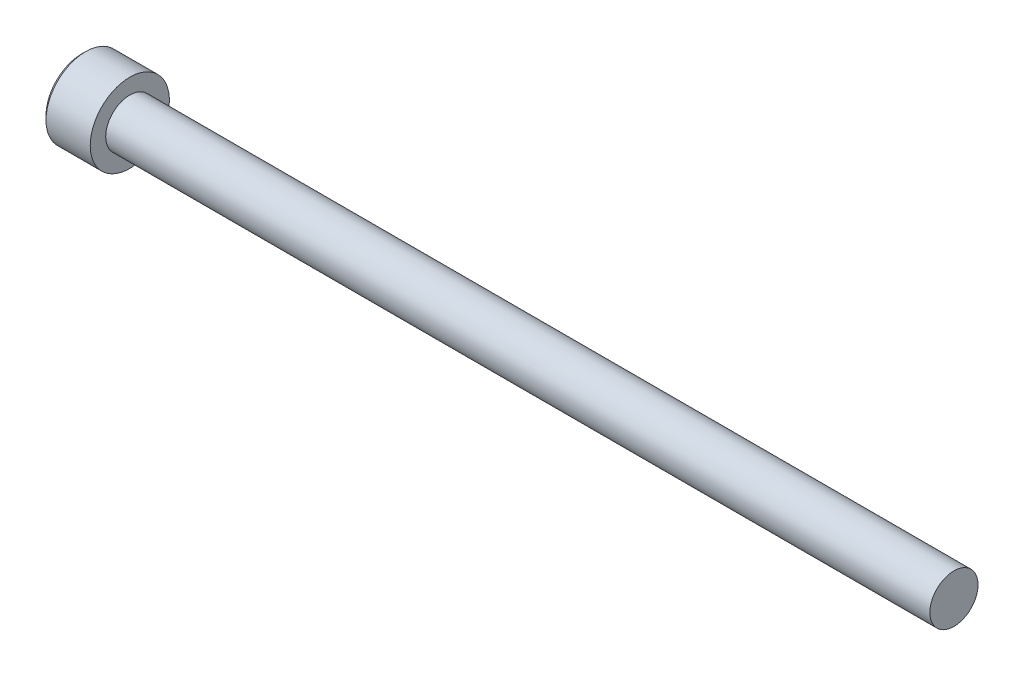
ISO-10303-21;
HEADER;
FILE_DESCRIPTION(('STEP AP214'),'2;1');
FILE_NAME('part.step','',(''),(''),'','','');
FILE_SCHEMA(('AUTOMOTIVE_DESIGN { 1 0 10303 214 1 1 1 1 }'));
ENDSEC;
DATA;
#1=APPLICATION_CONTEXT('core data for automotive mechanical design processes');
#2=APPLICATION_PROTOCOL_DEFINITION('international standard','automotive_design',2000,#1);
#3=PRODUCT_CONTEXT('',#1,'mechanical');
#4=PRODUCT('Part','Part','',(#3));
#5=PRODUCT_RELATED_PRODUCT_CATEGORY('part','',(#4));
#6=PRODUCT_DEFINITION_FORMATION('','',#4);
#7=PRODUCT_DEFINITION_CONTEXT('part definition',#1,'design');
#8=PRODUCT_DEFINITION('design','',#6,#7);
#9=PRODUCT_DEFINITION_SHAPE('','',#8);
#10=(LENGTH_UNIT() NAMED_UNIT(*) SI_UNIT(.MILLI.,.METRE.));
#11=(NAMED_UNIT(*) PLANE_ANGLE_UNIT() SI_UNIT($,.RADIAN.));
#12=(NAMED_UNIT(*) SI_UNIT($,.STERADIAN.) SOLID_ANGLE_UNIT());
#13=UNCERTAINTY_MEASURE_WITH_UNIT(LENGTH_MEASURE(1.E-05),#10,'distance_accuracy_value','');
#14=(GEOMETRIC_REPRESENTATION_CONTEXT(3) GLOBAL_UNCERTAINTY_ASSIGNED_CONTEXT((#13)) GLOBAL_UNIT_ASSIGNED_CONTEXT((#10,
#11,#12)) REPRESENTATION_CONTEXT('',''));
#15=CARTESIAN_POINT('',(0.,0.,0.));
#16=DIRECTION('',(0.,0.,1.));
#17=DIRECTION('',(1.,0.,0.));
#18=AXIS2_PLACEMENT_3D('',#15,#16,#17);
#19=CARTESIAN_POINT('',(-2.28600000000007,-1.14567944042317,1.984375));
#20=DIRECTION('',(0.,0.,1.));
#21=DIRECTION('',(1.,0.,0.));
#22=AXIS2_PLACEMENT_3D('',#19,#20,#21);
#23=PLANE('',#22);
#24=CARTESIAN_POINT('',(-4.82599999995852,1.14567944044653,1.98437499999554));
#25=CARTESIAN_POINT('',(-4.78691618362732,1.06743880343266,1.9843749999984));
#26=CARTESIAN_POINT('',(-4.75011447684892,0.987898318960917,1.98437499999957));
#27=CARTESIAN_POINT('',(-4.68265620500518,0.825677042028778,1.98437500000043));
#28=CARTESIAN_POINT('',(-4.65204056061138,0.742979382529199,1.98437500000012));
#29=CARTESIAN_POINT('',(-4.5991739228306,0.575193959555969,1.98437499999988));
#30=CARTESIAN_POINT('',(-4.57689462080725,0.490115359117279,1.98437499999997));
#31=CARTESIAN_POINT('',(-4.54259467221837,0.318093091130193,1.98437500000003));
#32=CARTESIAN_POINT('',(-4.5305423022885,0.231156054976726,1.984375));
#33=CARTESIAN_POINT('',(-4.52249110263747,0.119918521511051,1.984375));
#34=CARTESIAN_POINT('',(-4.52118947557477,0.0959468443046798,1.984375));
#35=CARTESIAN_POINT('',(-4.51945182629813,0.0479845644411998,1.984375));
#36=CARTESIAN_POINT('',(-4.51901533386223,0.0239939791589393,1.984375));
#37=CARTESIAN_POINT('',(-4.51901809008399,-0.0602201717457363,1.984375));
#38=CARTESIAN_POINT('',(-4.52177452299902,-0.120461721905447,1.984375));
#39=CARTESIAN_POINT('',(-4.5326365512493,-0.240474970989197,1.984375));
#40=CARTESIAN_POINT('',(-4.54074587749718,-0.300246312758427,1.984375));
#41=CARTESIAN_POINT('',(-4.57259622946939,-0.478763752804282,1.984375));
#42=CARTESIAN_POINT('',(-4.60385422611702,-0.596208828937734,1.984375));
#43=CARTESIAN_POINT('',(-4.66780003592237,-0.785921487441256,1.984375));
#44=CARTESIAN_POINT('',(-4.69623457768558,-0.859734609866899,1.984375));
#45=CARTESIAN_POINT('',(-4.75786140400812,-1.00456595519282,1.984375));
#46=CARTESIAN_POINT('',(-4.79100779300359,-1.07560356657101,1.984375));
#47=CARTESIAN_POINT('',(-4.82599999995643,-1.14567944044724,1.984375));
#48=B_SPLINE_CURVE_WITH_KNOTS('',3,(#24,#25,#26,#27,#28,#29,#30,#31,#32,#33,#34,#35,#36,#37,#38,
#39,#40,#41,#42,#43,#44,#45,#46,#47),.UNSPECIFIED.,.F.,.F.,(4,2,2,2,2,2,2,2,2,2,2,4),(0.,
0.262559005207405,0.526801735838036,0.790138824405318,1.05265603861765,1.12466619182083,
1.19663719499031,1.3772702672652,1.55802937209382,1.92104085090328,2.15819130092264,
2.39317265078575),.UNSPECIFIED.);
#49=CARTESIAN_POINT('',(-4.82599999996829,1.14567944041753,1.98437500003084));
#50=VERTEX_POINT('',#49);
#51=CARTESIAN_POINT('',(-4.8259999999622,-1.14567944043207,1.98437500001542));
#52=VERTEX_POINT('',#51);
#53=EDGE_CURVE('E20',#50,#52,#48,.T.);
#54=ORIENTED_EDGE('',*,*,#53,.F.);
#55=DIRECTION('',(1.,0.,0.));
#56=VECTOR('',#55,1.);
#57=CARTESIAN_POINT('',(-2.28600000000007,1.14567944042316,1.984375));
#58=LINE('',#57,#56);
#59=CARTESIAN_POINT('',(-2.28600000000007,1.14567944042316,1.984375));
#60=VERTEX_POINT('',#59);
#61=EDGE_CURVE('E68',#50,#60,#58,.T.);
#62=ORIENTED_EDGE('',*,*,#61,.T.);
#63=DIRECTION('',(0.,1.,0.));
#64=VECTOR('',#63,1.);
#65=CARTESIAN_POINT('',(-2.28600000000007,0.,1.984375));
#66=LINE('',#65,#64);
#67=CARTESIAN_POINT('',(-2.28600000000007,-1.14567944042317,1.984375));
#68=VERTEX_POINT('',#67);
#69=EDGE_CURVE('E74',#68,#60,#66,.T.);
#70=ORIENTED_EDGE('',*,*,#69,.F.);
#71=DIRECTION('',(1.,0.,0.));
#72=VECTOR('',#71,1.);
#73=CARTESIAN_POINT('',(-2.28600000000007,-1.14567944042317,1.984375));
#74=LINE('',#73,#72);
#75=EDGE_CURVE('E71',#68,#52,#74,.F.);
#76=ORIENTED_EDGE('',*,*,#75,.T.);
#77=EDGE_LOOP('',(#54,#62,#70,#76));
#78=FACE_BOUND('',#77,.T.);
#79=ADVANCED_FACE('F16',(#78),#23,.F.);
#80=CARTESIAN_POINT('',(-2.28600000000007,0.,0.));
#81=DIRECTION('',(-1.,0.,0.));
#82=DIRECTION('',(0.,0.,1.));
#83=AXIS2_PLACEMENT_3D('',#80,#81,#82);
#84=PLANE('',#83);
#85=DIRECTION('',(0.,0.5,0.866025403784439));
#86=VECTOR('',#85,1.);
#87=CARTESIAN_POINT('',(-2.28600000000007,2.29135888084633,0.));
#88=LINE('',#87,#86);
#89=CARTESIAN_POINT('',(-2.28600000000007,2.29135888084633,0.));
#90=VERTEX_POINT('',#89);
#91=CARTESIAN_POINT('',(-2.28600000000007,1.14567944042316,-1.984375));
#92=VERTEX_POINT('',#91);
#93=EDGE_CURVE('E82',#90,#92,#88,.F.);
#94=ORIENTED_EDGE('',*,*,#93,.T.);
#95=DIRECTION('',(0.,1.,0.));
#96=VECTOR('',#95,1.);
#97=CARTESIAN_POINT('',(-2.28600000000007,1.14567944042316,-1.984375));
#98=LINE('',#97,#96);
#99=CARTESIAN_POINT('',(-2.28600000000007,-1.14567944042316,-1.984375));
#100=VERTEX_POINT('',#99);
#101=EDGE_CURVE('E242',#92,#100,#98,.F.);
#102=ORIENTED_EDGE('',*,*,#101,.T.);
#103=DIRECTION('',(0.,0.5,-0.866025403784439));
#104=VECTOR('',#103,1.);
#105=CARTESIAN_POINT('',(-2.28600000000007,-1.14567944042316,-1.984375));
#106=LINE('',#105,#104);
#107=CARTESIAN_POINT('',(-2.28600000000007,-2.29135888084633,0.));
#108=VERTEX_POINT('',#107);
#109=EDGE_CURVE('E227',#100,#108,#106,.F.);
#110=ORIENTED_EDGE('',*,*,#109,.T.);
#111=DIRECTION('',(0.,-0.5,-0.866025403784439));
#112=VECTOR('',#111,1.);
#113=CARTESIAN_POINT('',(-2.28600000000007,-2.29135888084633,0.));
#114=LINE('',#113,#112);
#115=EDGE_CURVE('E224',#108,#68,#114,.F.);
#116=ORIENTED_EDGE('',*,*,#115,.T.);
#117=ORIENTED_EDGE('',*,*,#69,.T.);
#118=DIRECTION('',(0.,-0.5,0.866025403784439));
#119=VECTOR('',#118,1.);
#120=CARTESIAN_POINT('',(-2.28600000000007,1.14567944042316,1.984375));
#121=LINE('',#120,#119);
#122=EDGE_CURVE('E81',#60,#90,#121,.F.);
#123=ORIENTED_EDGE('',*,*,#122,.T.);
#124=EDGE_LOOP('',(#94,#102,#110,#116,#117,#123));
#125=FACE_BOUND('',#124,.T.);
#126=ADVANCED_FACE('F160',(#125),#84,.T.);
#127=CARTESIAN_POINT('',(-2.28600000000007,-1.14567944042316,-1.984375));
#128=DIRECTION('',(0.,-0.866025403784439,-0.5));
#129=DIRECTION('',(0.,0.5,-0.866025403784439));
#130=AXIS2_PLACEMENT_3D('',#127,#128,#129);
#131=PLANE('',#130);
#132=CARTESIAN_POINT('',(-4.82599999995871,-1.14567944040756,-1.98437500001887));
#133=CARTESIAN_POINT('',(-4.78666022792997,-1.18505700230148,-1.91617106214563));
#134=CARTESIAN_POINT('',(-4.74963132844072,-1.22509295783734,-1.8468267530301));
#135=CARTESIAN_POINT('',(-4.68183299424977,-1.30673037975396,-1.70542659047317));
#136=CARTESIAN_POINT('',(-4.65110127019237,-1.34833960561553,-1.63335729721673));
#137=CARTESIAN_POINT('',(-4.59845762010516,-1.432242568594,-1.48803310243203));
#138=CARTESIAN_POINT('',(-4.57641341195893,-1.47451494967301,-1.41481519064643));
#139=CARTESIAN_POINT('',(-4.54245011067441,-1.55999007976842,-1.26676792253773));
#140=CARTESIAN_POINT('',(-4.53050567471972,-1.6031902195197,-1.19194308559438));
#141=CARTESIAN_POINT('',(-4.51972842752365,-1.67764765054852,-1.06297903205139));
#142=CARTESIAN_POINT('',(-4.51813352794834,-1.70880881707173,-1.00900630841009));
#143=CARTESIAN_POINT('',(-4.52082392138599,-1.77108016542046,-0.901149169214274));
#144=CARTESIAN_POINT('',(-4.52511127545884,-1.80219032554946,-0.847264791239237));
#145=CARTESIAN_POINT('',(-4.53932219421538,-1.86411684097343,-0.740004920189235));
#146=CARTESIAN_POINT('',(-4.54925206045723,-1.8949328285454,-0.686630064029166));
#147=CARTESIAN_POINT('',(-4.5742029484467,-1.95603190279815,-0.580803363127978));
#148=CARTESIAN_POINT('',(-4.58922357974385,-1.98631503016081,-0.528351447923769));
#149=CARTESIAN_POINT('',(-4.63380478900425,-2.06386502548479,-0.394030915895904));
#150=CARTESIAN_POINT('',(-4.66672213384104,-2.11065153226583,-0.312994309042484));
#151=CARTESIAN_POINT('',(-4.72228952038986,-2.17944749410732,-0.193836207777459));
#152=CARTESIAN_POINT('',(-4.74181309375939,-2.20211890802843,-0.154568166986659));
#153=CARTESIAN_POINT('',(-4.78263970065987,-2.24704195201531,-0.0767591723707469));
#154=CARTESIAN_POINT('',(-4.80394164363173,-2.2692938292399,-0.0382177904539708));
#155=CARTESIAN_POINT('',(-4.82599999995675,-2.29135888085868,2.13931096265935E-11));
#156=B_SPLINE_CURVE_WITH_KNOTS('',3,(#132,#133,#134,#135,#136,#137,#138,#139,#140,#141,#142,
#143,#144,#145,#146,#147,#148,#149,#150,#151,#152,#153,#154,#155),.UNSPECIFIED.,.F.,.F.,(4,2,2,
2,2,2,2,2,2,2,2,4),(0.,0.264284909626495,0.530108996358094,0.791712695414128,1.05265800174404,
1.23942150116703,1.42625045663858,1.61328847394198,1.80031214908683,2.09727151182814,
2.24534838946042,2.39333511890876),.UNSPECIFIED.);
#157=CARTESIAN_POINT('',(-4.8259999999622,-1.14567944043207,-1.98437500001542));
#158=VERTEX_POINT('',#157);
#159=CARTESIAN_POINT('',(-4.82599999996846,-2.2913588808704,-2.00043543490866E-11));
#160=VERTEX_POINT('',#159);
#161=EDGE_CURVE('E162',#158,#160,#156,.T.);
#162=ORIENTED_EDGE('',*,*,#161,.T.);
#163=DIRECTION('',(1.,0.,0.));
#164=VECTOR('',#163,1.);
#165=CARTESIAN_POINT('',(-2.28600000000007,-2.29135888084633,0.));
#166=LINE('',#165,#164);
#167=EDGE_CURVE('E235',#160,#108,#166,.T.);
#168=ORIENTED_EDGE('',*,*,#167,.T.);
#169=ORIENTED_EDGE('',*,*,#109,.F.);
#170=DIRECTION('',(-1.,0.,0.));
#171=VECTOR('',#170,1.);
#172=CARTESIAN_POINT('',(-2.28600000000007,-1.14567944042316,-1.984375));
#173=LINE('',#172,#171);
#174=EDGE_CURVE('E245',#100,#158,#173,.T.);
#175=ORIENTED_EDGE('',*,*,#174,.T.);
#176=EDGE_LOOP('',(#162,#168,#169,#175));
#177=FACE_BOUND('',#176,.T.);
#178=ADVANCED_FACE('F156',(#177),#131,.F.);
#179=CARTESIAN_POINT('',(-2.28600000000007,-2.29135888084633,0.));
#180=DIRECTION('',(0.,-0.866025403784439,0.5));
#181=DIRECTION('',(0.,-0.5,-0.866025403784439));
#182=AXIS2_PLACEMENT_3D('',#179,#180,#181);
#183=PLANE('',#182);
#184=CARTESIAN_POINT('',(-4.8259999999587,-2.29135888085486,-2.29477011545215E-11));
#185=CARTESIAN_POINT('',(-4.78666022792997,-2.25198131896546,0.0682039378529047));
#186=CARTESIAN_POINT('',(-4.74963132844072,-2.21194536343147,0.137548246969502));
#187=CARTESIAN_POINT('',(-4.68183299424977,-2.13030794151622,0.278948409527228));
#188=CARTESIAN_POINT('',(-4.65110127019237,-2.08869871565414,0.351017702783377));
#189=CARTESIAN_POINT('',(-4.59845762010516,-2.00479575267531,0.496341897567867));
#190=CARTESIAN_POINT('',(-4.57641341195893,-1.96252337159644,0.569559809353539));
#191=CARTESIAN_POINT('',(-4.5424501106744,-1.87704824150112,0.717607077462299));
#192=CARTESIAN_POINT('',(-4.53050567471972,-1.8338481017498,0.792431914405622));
#193=CARTESIAN_POINT('',(-4.51972842752365,-1.75939067072096,0.921395967948603));
#194=CARTESIAN_POINT('',(-4.51813352794834,-1.72822950419776,0.975368691589913));
#195=CARTESIAN_POINT('',(-4.52082392138599,-1.66595815584903,1.08322583078573));
#196=CARTESIAN_POINT('',(-4.52511127545884,-1.63484799572003,1.13711020876076));
#197=CARTESIAN_POINT('',(-4.53932219421538,-1.57292148029607,1.24437007981077));
#198=CARTESIAN_POINT('',(-4.54925206045723,-1.54210549272409,1.29774493597084));
#199=CARTESIAN_POINT('',(-4.5742029484467,-1.48100641847134,1.40357163687202));
#200=CARTESIAN_POINT('',(-4.58922357974385,-1.45072329110868,1.45602355207623));
#201=CARTESIAN_POINT('',(-4.63380478900421,-1.37317329578476,1.59034408410398));
#202=CARTESIAN_POINT('',(-4.66672213384095,-1.32638678900379,1.6713806909573));
#203=CARTESIAN_POINT('',(-4.72228952038968,-1.25759082716239,1.79053879222216));
#204=CARTESIAN_POINT('',(-4.74181309375917,-1.23491941324131,1.82980683301291));
#205=CARTESIAN_POINT('',(-4.78263970065959,-1.18999636925449,1.90761582762873));
#206=CARTESIAN_POINT('',(-4.8039416436314,-1.16774449202993,1.94615720954545));
#207=CARTESIAN_POINT('',(-4.82599999995639,-1.14567944041117,1.98437500002077));
#208=B_SPLINE_CURVE_WITH_KNOTS('',3,(#184,#185,#186,#187,#188,#189,#190,#191,#192,#193,#194,
#195,#196,#197,#198,#199,#200,#201,#202,#203,#204,#205,#206,#207),.UNSPECIFIED.,.F.,.F.,(4,2,2,
2,2,2,2,2,2,2,2,4),(0.,0.264284909626493,0.530108996358089,0.791712695414125,1.05265800174404,
1.23942150116703,1.42625045663858,1.61328847394198,1.80031214908683,2.09727151182773,
2.24534838945981,2.39333511890795),.UNSPECIFIED.);
#209=EDGE_CURVE('E91',#160,#52,#208,.T.);
#210=ORIENTED_EDGE('',*,*,#209,.T.);
#211=ORIENTED_EDGE('',*,*,#75,.F.);
#212=ORIENTED_EDGE('',*,*,#115,.F.);
#213=ORIENTED_EDGE('',*,*,#167,.F.);
#214=EDGE_LOOP('',(#210,#211,#212,#213));
#215=FACE_BOUND('',#214,.T.);
#216=ADVANCED_FACE('F151',(#215),#183,.F.);
#217=CARTESIAN_POINT('',(-2.28600000000007,1.14567944042316,1.984375));
#218=DIRECTION('',(0.,0.866025403784439,0.5));
#219=DIRECTION('',(0.,-0.5,0.866025403784439));
#220=AXIS2_PLACEMENT_3D('',#217,#218,#219);
#221=PLANE('',#220);
#222=CARTESIAN_POINT('',(-4.82599999995852,1.14567944040762,1.98437500001801));
#223=CARTESIAN_POINT('',(-4.78666022792973,1.1850570023017,1.91617106214498));
#224=CARTESIAN_POINT('',(-4.74963132844047,1.22509295783761,1.84682675302957));
#225=CARTESIAN_POINT('',(-4.68183299424957,1.30673037975422,1.70542659047278));
#226=CARTESIAN_POINT('',(-4.65110127019222,1.34833960561574,1.63335729721638));
#227=CARTESIAN_POINT('',(-4.59845762010509,1.43224256859413,1.48803310243178));
#228=CARTESIAN_POINT('',(-4.57641341195888,1.47451494967311,1.41481519064625));
#229=CARTESIAN_POINT('',(-4.54245011067439,1.55999007976846,1.26676792253767));
#230=CARTESIAN_POINT('',(-4.53050567471972,1.6031902195197,1.19194308559439));
#231=CARTESIAN_POINT('',(-4.51972842752365,1.67764765054848,1.06297903205146));
#232=CARTESIAN_POINT('',(-4.51813352794835,1.70880881707169,1.00900630841016));
#233=CARTESIAN_POINT('',(-4.52082392138598,1.77108016542041,0.901149169214364));
#234=CARTESIAN_POINT('',(-4.52511127545883,1.80219032554941,0.847264791239333));
#235=CARTESIAN_POINT('',(-4.53932219421536,1.86411684097336,0.740004920189342));
#236=CARTESIAN_POINT('',(-4.54925206045721,1.89493282854533,0.686630064029278));
#237=CARTESIAN_POINT('',(-4.57420294844667,1.95603190279808,0.5808033631281));
#238=CARTESIAN_POINT('',(-4.58922357974382,1.98631503016074,0.528351447923897));
#239=CARTESIAN_POINT('',(-4.6338047890042,2.06386502548473,0.394030915896012));
#240=CARTESIAN_POINT('',(-4.666722133841,2.11065153226578,0.312994309042568));
#241=CARTESIAN_POINT('',(-4.72228952038984,2.17944749410729,0.19383620777751));
#242=CARTESIAN_POINT('',(-4.74181309375937,2.20211890802841,0.1545681669867));
#243=CARTESIAN_POINT('',(-4.78263970065986,2.24704195201529,0.0767591723707674));
#244=CARTESIAN_POINT('',(-4.80394164363172,2.26929382923989,0.0382177904539813));
#245=CARTESIAN_POINT('',(-4.82599999995675,2.29135888085868,-2.1392886942985E-11));
#246=B_SPLINE_CURVE_WITH_KNOTS('',3,(#222,#223,#224,#225,#226,#227,#228,#229,#230,#231,#232,
#233,#234,#235,#236,#237,#238,#239,#240,#241,#242,#243,#244,#245),.UNSPECIFIED.,.F.,.F.,(4,2,2,
2,2,2,2,2,2,2,2,4),(0.,0.26428490962629,0.530108996357672,0.791712695413487,1.05265800174319,
1.23942150116616,1.42625045663768,1.61328847394106,1.80031214908589,2.09727151182728,
2.2453483894596,2.39333511890798),.UNSPECIFIED.);
#247=CARTESIAN_POINT('',(-4.82599999996846,2.29135888087039,2.00042061038936E-11));
#248=VERTEX_POINT('',#247);
#249=EDGE_CURVE('E79',#50,#248,#246,.T.);
#250=ORIENTED_EDGE('',*,*,#249,.T.);
#251=DIRECTION('',(1.,0.,0.));
#252=VECTOR('',#251,1.);
#253=CARTESIAN_POINT('',(-2.28600000000007,2.29135888084633,0.));
#254=LINE('',#253,#252);
#255=EDGE_CURVE('E246',#248,#90,#254,.T.);
#256=ORIENTED_EDGE('',*,*,#255,.T.);
#257=ORIENTED_EDGE('',*,*,#122,.F.);
#258=ORIENTED_EDGE('',*,*,#61,.F.);
#259=EDGE_LOOP('',(#250,#256,#257,#258));
#260=FACE_BOUND('',#259,.T.);
#261=ADVANCED_FACE('F76',(#260),#221,.F.);
#262=CARTESIAN_POINT('',(-2.28600000000007,2.29135888084633,0.));
#263=DIRECTION('',(0.,0.866025403784439,-0.5));
#264=DIRECTION('',(0.,0.5,0.866025403784439));
#265=AXIS2_PLACEMENT_3D('',#262,#263,#264);
#266=PLANE('',#265);
#267=CARTESIAN_POINT('',(-4.82599999995871,2.29135888085486,2.29489280696874E-11));
#268=CARTESIAN_POINT('',(-4.78666022792997,2.25198131896547,-0.0682039378529039));
#269=CARTESIAN_POINT('',(-4.74963132844072,2.21194536343147,-0.137548246969502));
#270=CARTESIAN_POINT('',(-4.68183299424977,2.13030794151622,-0.278948409527229));
#271=CARTESIAN_POINT('',(-4.65110127019237,2.08869871565414,-0.351017702783379));
#272=CARTESIAN_POINT('',(-4.59845762010516,2.00479575267531,-0.496341897567869));
#273=CARTESIAN_POINT('',(-4.57641341195893,1.96252337159644,-0.569559809353541));
#274=CARTESIAN_POINT('',(-4.5424501106744,1.87704824150112,-0.7176070774623));
#275=CARTESIAN_POINT('',(-4.53050567471972,1.8338481017498,-0.792431914405622));
#276=CARTESIAN_POINT('',(-4.51972842752365,1.75939067072096,-0.921395967948603));
#277=CARTESIAN_POINT('',(-4.51813352794834,1.72822950419776,-0.975368691589912));
#278=CARTESIAN_POINT('',(-4.52082392138599,1.66595815584903,-1.08322583078573));
#279=CARTESIAN_POINT('',(-4.52511127545884,1.63484799572003,-1.13711020876076));
#280=CARTESIAN_POINT('',(-4.53932219421538,1.57292148029607,-1.24437007981077));
#281=CARTESIAN_POINT('',(-4.54925206045723,1.54210549272409,-1.29774493597083));
#282=CARTESIAN_POINT('',(-4.5742029484467,1.48100641847134,-1.40357163687202));
#283=CARTESIAN_POINT('',(-4.58922357974385,1.45072329110868,-1.45602355207623));
#284=CARTESIAN_POINT('',(-4.63380478900425,1.3731732957847,-1.5903440841041));
#285=CARTESIAN_POINT('',(-4.66672213384104,1.32638678900366,-1.67138069095752));
#286=CARTESIAN_POINT('',(-4.72228952038986,1.25759082716218,-1.79053879222254));
#287=CARTESIAN_POINT('',(-4.74181309375939,1.23491941324106,-1.82980683301334));
#288=CARTESIAN_POINT('',(-4.78263970065987,1.18999636925419,-1.90761582762925));
#289=CARTESIAN_POINT('',(-4.80394164363173,1.1677444920296,-1.94615720954603));
#290=CARTESIAN_POINT('',(-4.82599999995675,1.14567944041081,-1.98437500002139));
#291=B_SPLINE_CURVE_WITH_KNOTS('',3,(#267,#268,#269,#270,#271,#272,#273,#274,#275,#276,#277,
#278,#279,#280,#281,#282,#283,#284,#285,#286,#287,#288,#289,#290),.UNSPECIFIED.,.F.,.F.,(4,2,2,
2,2,2,2,2,2,2,2,4),(0.,0.264284909626495,0.530108996358093,0.791712695414127,1.05265800174404,
1.23942150116703,1.42625045663858,1.61328847394198,1.80031214908683,2.09727151182814,
2.24534838946042,2.39333511890876),.UNSPECIFIED.);
#292=CARTESIAN_POINT('',(-4.82599999996846,1.14567944045252,-1.98437500001084));
#293=VERTEX_POINT('',#292);
#294=EDGE_CURVE('E39',#248,#293,#291,.T.);
#295=ORIENTED_EDGE('',*,*,#294,.T.);
#296=DIRECTION('',(-1.,0.,0.));
#297=VECTOR('',#296,1.);
#298=CARTESIAN_POINT('',(-2.28600000000007,1.14567944042316,-1.984375));
#299=LINE('',#298,#297);
#300=EDGE_CURVE('E166',#293,#92,#299,.F.);
#301=ORIENTED_EDGE('',*,*,#300,.T.);
#302=ORIENTED_EDGE('',*,*,#93,.F.);
#303=ORIENTED_EDGE('',*,*,#255,.F.);
#304=EDGE_LOOP('',(#295,#301,#302,#303));
#305=FACE_BOUND('',#304,.T.);
#306=ADVANCED_FACE('F150',(#305),#266,.F.);
#307=CARTESIAN_POINT('',(-2.28600000000007,1.14567944042316,-1.984375));
#308=DIRECTION('',(0.,0.,-1.));
#309=DIRECTION('',(-1.,0.,0.));
#310=AXIS2_PLACEMENT_3D('',#307,#308,#309);
#311=PLANE('',#310);
#312=CARTESIAN_POINT('',(-4.8259999999587,1.14567944044731,-1.98437499999592));
#313=CARTESIAN_POINT('',(-4.78666022793094,1.06692431665146,-1.98437499999853));
#314=CARTESIAN_POINT('',(-4.74963132844318,0.986852405569011,-1.98437499999961));
#315=CARTESIAN_POINT('',(-4.6818329942566,0.823577561711963,-1.9843750000004));
#316=CARTESIAN_POINT('',(-4.65110127020207,0.740359109975722,-1.98437500000011));
#317=CARTESIAN_POINT('',(-4.59845762012233,0.572553183993917,-1.9843749999999));
#318=CARTESIAN_POINT('',(-4.57641341198063,0.488008421824127,-1.98437499999997));
#319=CARTESIAN_POINT('',(-4.54245011070673,0.317058161610178,-1.98437500000003));
#320=CARTESIAN_POINT('',(-4.53050567475816,0.230657882096267,-1.98437500000001));
#321=CARTESIAN_POINT('',(-4.51972842757294,0.0817430200124032,-1.984375));
#322=CARTESIAN_POINT('',(-4.51813352800283,0.0194206869508218,-1.984375));
#323=CARTESIAN_POINT('',(-4.52082392145254,-0.1051220097764,-1.984375));
#324=CARTESIAN_POINT('',(-4.52511127553227,-0.167342330049008,-1.984375));
#325=CARTESIAN_POINT('',(-4.53932219430377,-0.291195360925477,-1.984375));
#326=CARTESIAN_POINT('',(-4.54925206055372,-0.352827336083362,-1.984375));
#327=CARTESIAN_POINT('',(-4.57420294856008,-0.475025484616114,-1.984375));
#328=CARTESIAN_POINT('',(-4.58922357986604,-0.535591739354747,-1.984375));
#329=CARTESIAN_POINT('',(-4.63380478912724,-0.690691729958653,-1.984375));
#330=CARTESIAN_POINT('',(-4.66672213394715,-0.784264743465576,-1.984375));
#331=CARTESIAN_POINT('',(-4.7222895204619,-0.921856667069616,-1.984375));
#332=CARTESIAN_POINT('',(-4.74181309381856,-0.967199494886089,-1.984375));
#333=CARTESIAN_POINT('',(-4.78263970069104,-1.05704558280959,-1.984375));
#334=CARTESIAN_POINT('',(-4.80394164364776,-1.10154933723428,-1.984375));
#335=CARTESIAN_POINT('',(-4.82599999995675,-1.14567944044787,-1.984375));
#336=B_SPLINE_CURVE_WITH_KNOTS('',3,(#312,#313,#314,#315,#316,#317,#318,#319,#320,#321,#322,
#323,#324,#325,#326,#327,#328,#329,#330,#331,#332,#333,#334,#335),.UNSPECIFIED.,.F.,.F.,(4,2,2,
2,2,2,2,2,2,2,2,4),(0.,0.264284909658836,0.530108996422784,0.791712695509868,1.0526580018708,
1.23942150133878,1.42625045685537,1.61328847420389,1.80031214939384,2.09727151196384,
2.24534838950992,2.39333511887245),.UNSPECIFIED.);
#337=EDGE_CURVE('E108',#293,#158,#336,.T.);
#338=ORIENTED_EDGE('',*,*,#337,.T.);
#339=ORIENTED_EDGE('',*,*,#174,.F.);
#340=ORIENTED_EDGE('',*,*,#101,.F.);
#341=ORIENTED_EDGE('',*,*,#300,.F.);
#342=EDGE_LOOP('',(#338,#339,#340,#341));
#343=FACE_BOUND('',#342,.T.);
#344=ADVANCED_FACE('F121',(#343),#311,.F.);
#345=CARTESIAN_POINT('',(-4.82599999998001,0.,0.));
#346=DIRECTION('',(-1.,0.,0.));
#347=DIRECTION('',(0.,0.,1.));
#348=AXIS2_PLACEMENT_3D('',#345,#346,#347);
#349=CONICAL_SURFACE('',#348,2.29135888088194,0.785398163397448);
#350=ORIENTED_EDGE('',*,*,#161,.F.);
#351=CARTESIAN_POINT('',(-4.82599999998001,0.,0.));
#352=DIRECTION('',(-1.,0.,0.));
#353=DIRECTION('',(0.,0.,1.));
#354=AXIS2_PLACEMENT_3D('',#351,#352,#353);
#355=CIRCLE('',#354,2.29135888088194);
#356=EDGE_CURVE('E105',#158,#160,#355,.T.);
#357=ORIENTED_EDGE('',*,*,#356,.T.);
#358=EDGE_LOOP('',(#350,#357));
#359=FACE_BOUND('',#358,.T.);
#360=ADVANCED_FACE('F167',(#359),#349,.F.);
#361=CARTESIAN_POINT('',(-4.82599999998001,0.,0.));
#362=DIRECTION('',(-1.,0.,0.));
#363=DIRECTION('',(0.,0.,1.));
#364=AXIS2_PLACEMENT_3D('',#361,#362,#363);
#365=CONICAL_SURFACE('',#364,2.29135888088194,0.785398163397448);
#366=ORIENTED_EDGE('',*,*,#209,.F.);
#367=CARTESIAN_POINT('',(-4.82599999998001,0.,0.));
#368=DIRECTION('',(-1.,0.,0.));
#369=DIRECTION('',(0.,0.,1.));
#370=AXIS2_PLACEMENT_3D('',#367,#368,#369);
#371=CIRCLE('',#370,2.29135888088194);
#372=EDGE_CURVE('E86',#160,#52,#371,.T.);
#373=ORIENTED_EDGE('',*,*,#372,.T.);
#374=EDGE_LOOP('',(#366,#373));
#375=FACE_BOUND('',#374,.T.);
#376=ADVANCED_FACE('F170',(#375),#365,.F.);
#377=CARTESIAN_POINT('',(-4.82599999998001,0.,0.));
#378=DIRECTION('',(-1.,0.,0.));
#379=DIRECTION('',(0.,0.,1.));
#380=AXIS2_PLACEMENT_3D('',#377,#378,#379);
#381=CONICAL_SURFACE('',#380,2.29135888088194,0.78539816348948);
#382=CARTESIAN_POINT('',(-4.82599999998001,0.,0.));
#383=DIRECTION('',(-1.,0.,0.));
#384=DIRECTION('',(0.,0.,1.));
#385=AXIS2_PLACEMENT_3D('',#382,#383,#384);
#386=CIRCLE('',#385,2.29135888088194);
#387=EDGE_CURVE('E59',#52,#50,#386,.T.);
#388=ORIENTED_EDGE('',*,*,#387,.T.);
#389=ORIENTED_EDGE('',*,*,#53,.T.);
#390=EDGE_LOOP('',(#388,#389));
#391=FACE_BOUND('',#390,.T.);
#392=ADVANCED_FACE('F84',(#391),#381,.F.);
#393=CARTESIAN_POINT('',(-4.82599999998001,0.,0.));
#394=DIRECTION('',(-1.,0.,0.));
#395=DIRECTION('',(0.,0.,1.));
#396=AXIS2_PLACEMENT_3D('',#393,#394,#395);
#397=CONICAL_SURFACE('',#396,2.29135888088194,0.785398163397448);
#398=ORIENTED_EDGE('',*,*,#249,.F.);
#399=CARTESIAN_POINT('',(-4.82599999998001,0.,0.));
#400=DIRECTION('',(-1.,0.,0.));
#401=DIRECTION('',(0.,0.,1.));
#402=AXIS2_PLACEMENT_3D('',#399,#400,#401);
#403=CIRCLE('',#402,2.29135888088194);
#404=EDGE_CURVE('E85',#50,#248,#403,.T.);
#405=ORIENTED_EDGE('',*,*,#404,.T.);
#406=EDGE_LOOP('',(#398,#405));
#407=FACE_BOUND('',#406,.T.);
#408=ADVANCED_FACE('F90',(#407),#397,.F.);
#409=CARTESIAN_POINT('',(-4.82599999998001,0.,0.));
#410=DIRECTION('',(-1.,0.,0.));
#411=DIRECTION('',(0.,0.,1.));
#412=AXIS2_PLACEMENT_3D('',#409,#410,#411);
#413=CONICAL_SURFACE('',#412,2.29135888088194,0.785398163397448);
#414=ORIENTED_EDGE('',*,*,#294,.F.);
#415=CARTESIAN_POINT('',(-4.82599999998001,0.,0.));
#416=DIRECTION('',(-1.,0.,0.));
#417=DIRECTION('',(0.,0.,1.));
#418=AXIS2_PLACEMENT_3D('',#415,#416,#417);
#419=CIRCLE('',#418,2.29135888088194);
#420=EDGE_CURVE('E97',#248,#293,#419,.T.);
#421=ORIENTED_EDGE('',*,*,#420,.T.);
#422=EDGE_LOOP('',(#414,#421));
#423=FACE_BOUND('',#422,.T.);
#424=ADVANCED_FACE('F128',(#423),#413,.F.);
#425=CARTESIAN_POINT('',(-4.82599999998001,0.,0.));
#426=DIRECTION('',(-1.,0.,0.));
#427=DIRECTION('',(0.,0.,1.));
#428=AXIS2_PLACEMENT_3D('',#425,#426,#427);
#429=CONICAL_SURFACE('',#428,2.29135888088194,0.785398163489476);
#430=ORIENTED_EDGE('',*,*,#337,.F.);
#431=CARTESIAN_POINT('',(-4.82599999998001,0.,0.));
#432=DIRECTION('',(-1.,0.,0.));
#433=DIRECTION('',(0.,0.,1.));
#434=AXIS2_PLACEMENT_3D('',#431,#432,#433);
#435=CIRCLE('',#434,2.29135888088194);
#436=EDGE_CURVE('E99',#293,#158,#435,.T.);
#437=ORIENTED_EDGE('',*,*,#436,.T.);
#438=EDGE_LOOP('',(#430,#437));
#439=FACE_BOUND('',#438,.T.);
#440=ADVANCED_FACE('F124',(#439),#429,.F.);
#441=CARTESIAN_POINT('',(-4.82600000000007,0.,0.));
#442=DIRECTION('',(1.,0.,0.));
#443=DIRECTION('',(0.,0.,-1.));
#444=AXIS2_PLACEMENT_3D('',#441,#442,#443);
#445=PLANE('',#444);
#446=CARTESIAN_POINT('',(-4.82599999998001,0.,0.));
#447=DIRECTION('',(1.,0.,0.));
#448=DIRECTION('',(0.,0.,-1.));
#449=AXIS2_PLACEMENT_3D('',#446,#447,#448);
#450=CIRCLE('',#449,3.56615999999121);
#451=CARTESIAN_POINT('',(-4.82599999998001,0.,-3.56615999999121));
#452=VERTEX_POINT('',#451);
#453=EDGE_CURVE('E212',#452,#452,#450,.T.);
#454=ORIENTED_EDGE('',*,*,#453,.F.);
#455=EDGE_LOOP('',(#454));
#456=FACE_BOUND('',#455,.T.);
#457=ORIENTED_EDGE('',*,*,#420,.F.);
#458=ORIENTED_EDGE('',*,*,#404,.F.);
#459=ORIENTED_EDGE('',*,*,#387,.F.);
#460=ORIENTED_EDGE('',*,*,#372,.F.);
#461=ORIENTED_EDGE('',*,*,#356,.F.);
#462=ORIENTED_EDGE('',*,*,#436,.F.);
#463=EDGE_LOOP('',(#457,#458,#459,#460,#461,#462));
#464=FACE_BOUND('',#463,.T.);
#465=ADVANCED_FACE('F94',(#456,#464),#445,.F.);
#466=CARTESIAN_POINT('',(-4.42976000010731,0.,0.));
#467=DIRECTION('',(1.,0.,0.));
#468=DIRECTION('',(0.,0.,-1.));
#469=AXIS2_PLACEMENT_3D('',#466,#467,#468);
#470=CONICAL_SURFACE('',#469,3.96239999986392,0.785398163397448);
#471=CARTESIAN_POINT('',(-4.42976000000007,0.,0.));
#472=DIRECTION('',(-1.,0.,0.));
#473=DIRECTION('',(0.,0.,1.));
#474=AXIS2_PLACEMENT_3D('',#471,#472,#473);
#475=CIRCLE('',#474,3.9624);
#476=CARTESIAN_POINT('',(-4.42976000000007,0.,3.9624));
#477=VERTEX_POINT('',#476);
#478=EDGE_CURVE('E209',#477,#477,#475,.F.);
#479=ORIENTED_EDGE('',*,*,#478,.F.);
#480=EDGE_LOOP('',(#479));
#481=FACE_BOUND('',#480,.T.);
#482=ORIENTED_EDGE('',*,*,#453,.T.);
#483=EDGE_LOOP('',(#482));
#484=FACE_BOUND('',#483,.T.);
#485=ADVANCED_FACE('F198',(#481,#484),#470,.T.);
#486=CARTESIAN_POINT('',(-4.82600000000008,0.,0.));
#487=DIRECTION('',(-1.,0.,0.));
#488=DIRECTION('',(0.,0.,1.));
#489=AXIS2_PLACEMENT_3D('',#486,#487,#488);
#490=CYLINDRICAL_SURFACE('',#489,3.9624);
#491=ORIENTED_EDGE('',*,*,#478,.T.);
#492=EDGE_LOOP('',(#491));
#493=FACE_BOUND('',#492,.T.);
#494=CARTESIAN_POINT('',(0.,0.,0.));
#495=DIRECTION('',(-1.,0.,0.));
#496=DIRECTION('',(0.,0.,1.));
#497=AXIS2_PLACEMENT_3D('',#494,#495,#496);
#498=CIRCLE('',#497,3.9624);
#499=CARTESIAN_POINT('',(0.,0.,3.9624));
#500=VERTEX_POINT('',#499);
#501=EDGE_CURVE('E214',#500,#500,#498,.T.);
#502=ORIENTED_EDGE('',*,*,#501,.T.);
#503=EDGE_LOOP('',(#502));
#504=FACE_BOUND('',#503,.T.);
#505=ADVANCED_FACE('F195',(#493,#504),#490,.T.);
#506=CARTESIAN_POINT('',(82.55,0.,0.));
#507=DIRECTION('',(1.,0.,0.));
#508=DIRECTION('',(0.,0.,-1.));
#509=AXIS2_PLACEMENT_3D('',#506,#507,#508);
#510=PLANE('',#509);
#511=CARTESIAN_POINT('',(82.55,0.,0.));
#512=DIRECTION('',(-1.,0.,0.));
#513=DIRECTION('',(0.,0.,1.));
#514=AXIS2_PLACEMENT_3D('',#511,#512,#513);
#515=CIRCLE('',#514,2.413);
#516=CARTESIAN_POINT('',(82.55,0.,2.413));
#517=VERTEX_POINT('',#516);
#518=EDGE_CURVE('E30',#517,#517,#515,.T.);
#519=ORIENTED_EDGE('',*,*,#518,.F.);
#520=EDGE_LOOP('',(#519));
#521=FACE_BOUND('',#520,.T.);
#522=ADVANCED_FACE('F188',(#521),#510,.T.);
#523=CARTESIAN_POINT('',(0.,3.9624,0.));
#524=DIRECTION('',(-1.,0.,0.));
#525=DIRECTION('',(0.,0.,1.));
#526=AXIS2_PLACEMENT_3D('',#523,#524,#525);
#527=PLANE('',#526);
#528=CARTESIAN_POINT('',(0.,0.,0.));
#529=DIRECTION('',(-1.,0.,0.));
#530=DIRECTION('',(0.,0.,1.));
#531=AXIS2_PLACEMENT_3D('',#528,#529,#530);
#532=CIRCLE('',#531,2.413);
#533=CARTESIAN_POINT('',(0.,0.,2.413));
#534=VERTEX_POINT('',#533);
#535=EDGE_CURVE('E11',#534,#534,#532,.F.);
#536=ORIENTED_EDGE('',*,*,#535,.F.);
#537=EDGE_LOOP('',(#536));
#538=FACE_BOUND('',#537,.T.);
#539=ORIENTED_EDGE('',*,*,#501,.F.);
#540=EDGE_LOOP('',(#539));
#541=FACE_BOUND('',#540,.T.);
#542=ADVANCED_FACE('F182',(#538,#541),#527,.F.);
#543=CARTESIAN_POINT('',(82.55,0.,0.));
#544=DIRECTION('',(-1.,0.,0.));
#545=DIRECTION('',(0.,0.,1.));
#546=AXIS2_PLACEMENT_3D('',#543,#544,#545);
#547=CYLINDRICAL_SURFACE('',#546,2.413);
#548=ORIENTED_EDGE('',*,*,#535,.T.);
#549=EDGE_LOOP('',(#548));
#550=FACE_BOUND('',#549,.T.);
#551=ORIENTED_EDGE('',*,*,#518,.T.);
#552=EDGE_LOOP('',(#551));
#553=FACE_BOUND('',#552,.T.);
#554=ADVANCED_FACE('F180',(#550,#553),#547,.T.);
#555=CLOSED_SHELL('',(#79,#126,#178,#216,#261,#306,#344,#360,#376,#392,#408,#424,#440,#465,#485,
#505,#522,#542,#554));
#556=MANIFOLD_SOLID_BREP('B1',#555);
#557=ADVANCED_BREP_SHAPE_REPRESENTATION('',(#18,#556),#14);
#558=SHAPE_DEFINITION_REPRESENTATION(#9,#557);
ENDSEC;
END-ISO-10303-21;
